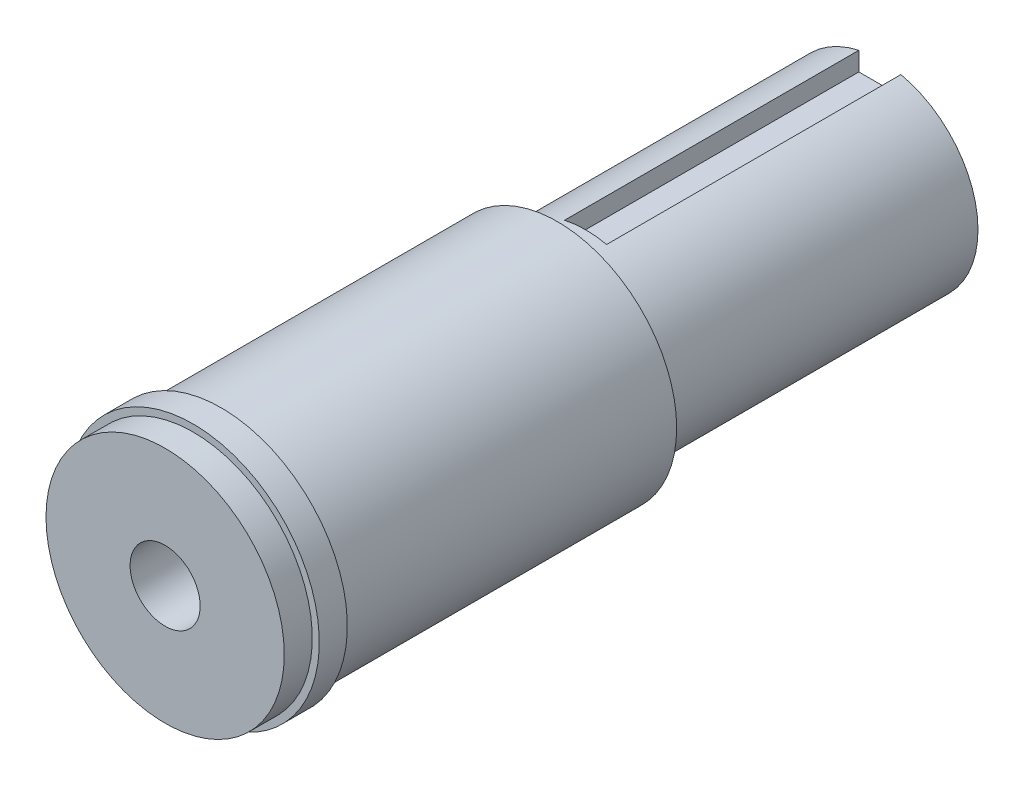
ISO-10303-21;
HEADER;
FILE_DESCRIPTION(('STEP AP214'),'2;1');
FILE_NAME('part.step','',(''),(''),'','','');
FILE_SCHEMA(('AUTOMOTIVE_DESIGN { 1 0 10303 214 1 1 1 1 }'));
ENDSEC;
DATA;
#1=APPLICATION_CONTEXT('core data for automotive mechanical design processes');
#2=APPLICATION_PROTOCOL_DEFINITION('international standard','automotive_design',2000,#1);
#3=PRODUCT_CONTEXT('',#1,'mechanical');
#4=PRODUCT('Part','Part','',(#3));
#5=PRODUCT_RELATED_PRODUCT_CATEGORY('part','',(#4));
#6=PRODUCT_DEFINITION_FORMATION('','',#4);
#7=PRODUCT_DEFINITION_CONTEXT('part definition',#1,'design');
#8=PRODUCT_DEFINITION('design','',#6,#7);
#9=PRODUCT_DEFINITION_SHAPE('','',#8);
#10=(LENGTH_UNIT() NAMED_UNIT(*) SI_UNIT(.MILLI.,.METRE.));
#11=(NAMED_UNIT(*) PLANE_ANGLE_UNIT() SI_UNIT($,.RADIAN.));
#12=(NAMED_UNIT(*) SI_UNIT($,.STERADIAN.) SOLID_ANGLE_UNIT());
#13=UNCERTAINTY_MEASURE_WITH_UNIT(LENGTH_MEASURE(1.E-05),#10,'distance_accuracy_value','');
#14=(GEOMETRIC_REPRESENTATION_CONTEXT(3) GLOBAL_UNCERTAINTY_ASSIGNED_CONTEXT((#13)) GLOBAL_UNIT_ASSIGNED_CONTEXT((#10,
#11,#12)) REPRESENTATION_CONTEXT('',''));
#15=CARTESIAN_POINT('',(0.,0.,0.));
#16=DIRECTION('',(0.,0.,1.));
#17=DIRECTION('',(1.,0.,0.));
#18=AXIS2_PLACEMENT_3D('',#15,#16,#17);
#19=CARTESIAN_POINT('',(0.,0.,23.));
#20=DIRECTION('',(0.,0.,-1.));
#21=DIRECTION('',(-1.,0.,0.));
#22=AXIS2_PLACEMENT_3D('',#19,#20,#21);
#23=CYLINDRICAL_SURFACE('',#22,7.);
#24=CARTESIAN_POINT('',(0.,0.,23.));
#25=DIRECTION('',(0.,0.,1.));
#26=DIRECTION('',(1.,0.,0.));
#27=AXIS2_PLACEMENT_3D('',#24,#25,#26);
#28=CIRCLE('',#27,7.);
#29=CARTESIAN_POINT('',(7.,0.,23.));
#30=VERTEX_POINT('',#29);
#31=EDGE_CURVE('E127',#30,#30,#28,.T.);
#32=ORIENTED_EDGE('',*,*,#31,.F.);
#33=EDGE_LOOP('',(#32));
#34=FACE_BOUND('',#33,.T.);
#35=CARTESIAN_POINT('',(0.,0.,21.));
#36=DIRECTION('',(0.,0.,1.));
#37=DIRECTION('',(1.,0.,0.));
#38=AXIS2_PLACEMENT_3D('',#35,#36,#37);
#39=CIRCLE('',#38,7.);
#40=CARTESIAN_POINT('',(1.5,6.83739716558867,21.));
#41=VERTEX_POINT('',#40);
#42=CARTESIAN_POINT('',(-1.5,6.83739716558867,21.));
#43=VERTEX_POINT('',#42);
#44=EDGE_CURVE('E43',#41,#43,#39,.T.);
#45=ORIENTED_EDGE('',*,*,#44,.T.);
#46=DIRECTION('',(0.,0.,-1.));
#47=VECTOR('',#46,1.);
#48=CARTESIAN_POINT('',(-1.5,6.83739716558867,23.));
#49=LINE('',#48,#47);
#50=CARTESIAN_POINT('',(-1.5,6.83739716558867,0.));
#51=VERTEX_POINT('',#50);
#52=EDGE_CURVE('E58',#43,#51,#49,.T.);
#53=ORIENTED_EDGE('',*,*,#52,.T.);
#54=CARTESIAN_POINT('',(0.,0.,0.));
#55=DIRECTION('',(0.,0.,1.));
#56=DIRECTION('',(1.,0.,0.));
#57=AXIS2_PLACEMENT_3D('',#54,#55,#56);
#58=CIRCLE('',#57,7.);
#59=CARTESIAN_POINT('',(1.5,6.83739716558867,0.));
#60=VERTEX_POINT('',#59);
#61=EDGE_CURVE('E126',#51,#60,#58,.T.);
#62=ORIENTED_EDGE('',*,*,#61,.T.);
#63=DIRECTION('',(0.,0.,-1.));
#64=VECTOR('',#63,1.);
#65=CARTESIAN_POINT('',(1.5,6.83739716558867,23.));
#66=LINE('',#65,#64);
#67=EDGE_CURVE('E50',#60,#41,#66,.F.);
#68=ORIENTED_EDGE('',*,*,#67,.T.);
#69=EDGE_LOOP('',(#45,#53,#62,#68));
#70=FACE_BOUND('',#69,.T.);
#71=ADVANCED_FACE('F36',(#34,#70),#23,.T.);
#72=CARTESIAN_POINT('',(0.,0.,0.));
#73=DIRECTION('',(0.,0.,1.));
#74=DIRECTION('',(1.,0.,0.));
#75=AXIS2_PLACEMENT_3D('',#72,#73,#74);
#76=PLANE('',#75);
#77=ORIENTED_EDGE('',*,*,#61,.F.);
#78=DIRECTION('',(0.,1.,0.));
#79=VECTOR('',#78,1.);
#80=CARTESIAN_POINT('',(-1.5,5.5,0.));
#81=LINE('',#80,#79);
#82=CARTESIAN_POINT('',(-1.5,5.5,0.));
#83=VERTEX_POINT('',#82);
#84=EDGE_CURVE('E104',#83,#51,#81,.T.);
#85=ORIENTED_EDGE('',*,*,#84,.F.);
#86=DIRECTION('',(-1.,0.,0.));
#87=VECTOR('',#86,1.);
#88=CARTESIAN_POINT('',(1.5,5.5,0.));
#89=LINE('',#88,#87);
#90=CARTESIAN_POINT('',(1.5,5.5,0.));
#91=VERTEX_POINT('',#90);
#92=EDGE_CURVE('E111',#91,#83,#89,.T.);
#93=ORIENTED_EDGE('',*,*,#92,.F.);
#94=DIRECTION('',(0.,1.,0.));
#95=VECTOR('',#94,1.);
#96=CARTESIAN_POINT('',(1.5,0.,0.));
#97=LINE('',#96,#95);
#98=EDGE_CURVE('E130',#91,#60,#97,.T.);
#99=ORIENTED_EDGE('',*,*,#98,.T.);
#100=EDGE_LOOP('',(#77,#85,#93,#99));
#101=FACE_BOUND('',#100,.T.);
#102=ADVANCED_FACE('F164',(#101),#76,.F.);
#103=CARTESIAN_POINT('',(0.,0.,21.));
#104=DIRECTION('',(0.,0.,1.));
#105=DIRECTION('',(1.,0.,0.));
#106=AXIS2_PLACEMENT_3D('',#103,#104,#105);
#107=PLANE('',#106);
#108=DIRECTION('',(0.,-1.,0.));
#109=VECTOR('',#108,1.);
#110=CARTESIAN_POINT('',(1.5,5.5,21.));
#111=LINE('',#110,#109);
#112=CARTESIAN_POINT('',(1.5,5.5,21.));
#113=VERTEX_POINT('',#112);
#114=EDGE_CURVE('E110',#41,#113,#111,.T.);
#115=ORIENTED_EDGE('',*,*,#114,.T.);
#116=DIRECTION('',(-1.,0.,0.));
#117=VECTOR('',#116,1.);
#118=CARTESIAN_POINT('',(1.5,5.5,21.));
#119=LINE('',#118,#117);
#120=CARTESIAN_POINT('',(-1.5,5.5,21.));
#121=VERTEX_POINT('',#120);
#122=EDGE_CURVE('E113',#113,#121,#119,.T.);
#123=ORIENTED_EDGE('',*,*,#122,.T.);
#124=DIRECTION('',(0.,1.,0.));
#125=VECTOR('',#124,1.);
#126=CARTESIAN_POINT('',(-1.5,5.5,21.));
#127=LINE('',#126,#125);
#128=EDGE_CURVE('E108',#121,#43,#127,.T.);
#129=ORIENTED_EDGE('',*,*,#128,.T.);
#130=ORIENTED_EDGE('',*,*,#44,.F.);
#131=EDGE_LOOP('',(#115,#123,#129,#130));
#132=FACE_BOUND('',#131,.T.);
#133=ADVANCED_FACE('F169',(#132),#107,.F.);
#134=CARTESIAN_POINT('',(-1.5,5.5,21.));
#135=DIRECTION('',(-1.,0.,0.));
#136=DIRECTION('',(0.,0.,1.));
#137=AXIS2_PLACEMENT_3D('',#134,#135,#136);
#138=PLANE('',#137);
#139=ORIENTED_EDGE('',*,*,#128,.F.);
#140=DIRECTION('',(0.,0.,-1.));
#141=VECTOR('',#140,1.);
#142=CARTESIAN_POINT('',(-1.5,5.5,21.));
#143=LINE('',#142,#141);
#144=EDGE_CURVE('E120',#121,#83,#143,.T.);
#145=ORIENTED_EDGE('',*,*,#144,.T.);
#146=ORIENTED_EDGE('',*,*,#84,.T.);
#147=ORIENTED_EDGE('',*,*,#52,.F.);
#148=EDGE_LOOP('',(#139,#145,#146,#147));
#149=FACE_BOUND('',#148,.T.);
#150=ADVANCED_FACE('F182',(#149),#138,.F.);
#151=CARTESIAN_POINT('',(1.5,5.5,21.));
#152=DIRECTION('',(1.,0.,0.));
#153=DIRECTION('',(0.,0.,-1.));
#154=AXIS2_PLACEMENT_3D('',#151,#152,#153);
#155=PLANE('',#154);
#156=ORIENTED_EDGE('',*,*,#98,.F.);
#157=DIRECTION('',(0.,0.,-1.));
#158=VECTOR('',#157,1.);
#159=CARTESIAN_POINT('',(1.5,5.5,21.));
#160=LINE('',#159,#158);
#161=EDGE_CURVE('E116',#113,#91,#160,.T.);
#162=ORIENTED_EDGE('',*,*,#161,.F.);
#163=ORIENTED_EDGE('',*,*,#114,.F.);
#164=ORIENTED_EDGE('',*,*,#67,.F.);
#165=EDGE_LOOP('',(#156,#162,#163,#164));
#166=FACE_BOUND('',#165,.T.);
#167=ADVANCED_FACE('F176',(#166),#155,.F.);
#168=CARTESIAN_POINT('',(1.5,5.5,21.));
#169=DIRECTION('',(0.,-1.,0.));
#170=DIRECTION('',(0.,0.,-1.));
#171=AXIS2_PLACEMENT_3D('',#168,#169,#170);
#172=PLANE('',#171);
#173=ORIENTED_EDGE('',*,*,#92,.T.);
#174=ORIENTED_EDGE('',*,*,#144,.F.);
#175=ORIENTED_EDGE('',*,*,#122,.F.);
#176=ORIENTED_EDGE('',*,*,#161,.T.);
#177=EDGE_LOOP('',(#173,#174,#175,#176));
#178=FACE_BOUND('',#177,.T.);
#179=ADVANCED_FACE('F180',(#178),#172,.F.);
#180=CARTESIAN_POINT('',(0.,0.,51.));
#181=DIRECTION('',(0.,0.,-1.));
#182=DIRECTION('',(-1.,0.,0.));
#183=AXIS2_PLACEMENT_3D('',#180,#181,#182);
#184=CYLINDRICAL_SURFACE('',#183,8.5);
#185=CARTESIAN_POINT('',(0.,0.,47.));
#186=DIRECTION('',(0.,0.,-1.));
#187=DIRECTION('',(-1.,0.,0.));
#188=AXIS2_PLACEMENT_3D('',#185,#186,#187);
#189=CIRCLE('',#188,8.5);
#190=CARTESIAN_POINT('',(-8.5,0.,47.));
#191=VERTEX_POINT('',#190);
#192=EDGE_CURVE('E99',#191,#191,#189,.T.);
#193=ORIENTED_EDGE('',*,*,#192,.T.);
#194=EDGE_LOOP('',(#193));
#195=FACE_BOUND('',#194,.T.);
#196=CARTESIAN_POINT('',(0.,0.,23.));
#197=DIRECTION('',(0.,0.,1.));
#198=DIRECTION('',(1.,0.,0.));
#199=AXIS2_PLACEMENT_3D('',#196,#197,#198);
#200=CIRCLE('',#199,8.5);
#201=CARTESIAN_POINT('',(8.5,0.,23.));
#202=VERTEX_POINT('',#201);
#203=EDGE_CURVE('E105',#202,#202,#200,.T.);
#204=ORIENTED_EDGE('',*,*,#203,.T.);
#205=EDGE_LOOP('',(#204));
#206=FACE_BOUND('',#205,.T.);
#207=ADVANCED_FACE('F138',(#195,#206),#184,.T.);
#208=CARTESIAN_POINT('',(0.,0.,23.));
#209=DIRECTION('',(0.,0.,1.));
#210=DIRECTION('',(1.,0.,0.));
#211=AXIS2_PLACEMENT_3D('',#208,#209,#210);
#212=PLANE('',#211);
#213=ORIENTED_EDGE('',*,*,#31,.T.);
#214=EDGE_LOOP('',(#213));
#215=FACE_BOUND('',#214,.T.);
#216=ORIENTED_EDGE('',*,*,#203,.F.);
#217=EDGE_LOOP('',(#216));
#218=FACE_BOUND('',#217,.T.);
#219=ADVANCED_FACE('F151',(#215,#218),#212,.F.);
#220=CARTESIAN_POINT('',(0.,0.,49.));
#221=DIRECTION('',(0.,0.,-1.));
#222=DIRECTION('',(-1.,0.,0.));
#223=AXIS2_PLACEMENT_3D('',#220,#221,#222);
#224=CYLINDRICAL_SURFACE('',#223,9.);
#225=CARTESIAN_POINT('',(0.,0.,49.));
#226=DIRECTION('',(0.,0.,-1.));
#227=DIRECTION('',(-1.,0.,0.));
#228=AXIS2_PLACEMENT_3D('',#225,#226,#227);
#229=CIRCLE('',#228,9.);
#230=CARTESIAN_POINT('',(-9.,0.,49.));
#231=VERTEX_POINT('',#230);
#232=EDGE_CURVE('E93',#231,#231,#229,.T.);
#233=ORIENTED_EDGE('',*,*,#232,.T.);
#234=EDGE_LOOP('',(#233));
#235=FACE_BOUND('',#234,.T.);
#236=CARTESIAN_POINT('',(0.,0.,47.));
#237=DIRECTION('',(0.,0.,-1.));
#238=DIRECTION('',(-1.,0.,0.));
#239=AXIS2_PLACEMENT_3D('',#236,#237,#238);
#240=CIRCLE('',#239,9.);
#241=CARTESIAN_POINT('',(-9.,0.,47.));
#242=VERTEX_POINT('',#241);
#243=EDGE_CURVE('E89',#242,#242,#240,.T.);
#244=ORIENTED_EDGE('',*,*,#243,.F.);
#245=EDGE_LOOP('',(#244));
#246=FACE_BOUND('',#245,.T.);
#247=ADVANCED_FACE('F149',(#235,#246),#224,.T.);
#248=CARTESIAN_POINT('',(0.,0.,49.));
#249=DIRECTION('',(0.,0.,-1.));
#250=DIRECTION('',(-1.,0.,0.));
#251=AXIS2_PLACEMENT_3D('',#248,#249,#250);
#252=PLANE('',#251);
#253=CARTESIAN_POINT('',(0.,0.,49.));
#254=DIRECTION('',(0.,0.,-1.));
#255=DIRECTION('',(-1.,0.,0.));
#256=AXIS2_PLACEMENT_3D('',#253,#254,#255);
#257=CIRCLE('',#256,8.5);
#258=CARTESIAN_POINT('',(-8.5,0.,49.));
#259=VERTEX_POINT('',#258);
#260=EDGE_CURVE('E11',#259,#259,#257,.T.);
#261=ORIENTED_EDGE('',*,*,#260,.T.);
#262=EDGE_LOOP('',(#261));
#263=FACE_BOUND('',#262,.T.);
#264=ORIENTED_EDGE('',*,*,#232,.F.);
#265=EDGE_LOOP('',(#264));
#266=FACE_BOUND('',#265,.T.);
#267=ADVANCED_FACE('F145',(#263,#266),#252,.F.);
#268=CARTESIAN_POINT('',(0.,0.,47.));
#269=DIRECTION('',(0.,0.,-1.));
#270=DIRECTION('',(-1.,0.,0.));
#271=AXIS2_PLACEMENT_3D('',#268,#269,#270);
#272=PLANE('',#271);
#273=ORIENTED_EDGE('',*,*,#192,.F.);
#274=EDGE_LOOP('',(#273));
#275=FACE_BOUND('',#274,.T.);
#276=ORIENTED_EDGE('',*,*,#243,.T.);
#277=EDGE_LOOP('',(#276));
#278=FACE_BOUND('',#277,.T.);
#279=ADVANCED_FACE('F141',(#275,#278),#272,.T.);
#280=CARTESIAN_POINT('',(0.,0.,51.));
#281=DIRECTION('',(0.,0.,1.));
#282=DIRECTION('',(1.,0.,0.));
#283=AXIS2_PLACEMENT_3D('',#280,#281,#282);
#284=PLANE('',#283);
#285=CARTESIAN_POINT('',(0.,0.,51.));
#286=DIRECTION('',(0.,0.,1.));
#287=DIRECTION('',(1.,0.,0.));
#288=AXIS2_PLACEMENT_3D('',#285,#286,#287);
#289=CIRCLE('',#288,2.49999999999999);
#290=CARTESIAN_POINT('',(2.49999999999999,0.,51.));
#291=VERTEX_POINT('',#290);
#292=EDGE_CURVE('E90',#291,#291,#289,.T.);
#293=ORIENTED_EDGE('',*,*,#292,.F.);
#294=EDGE_LOOP('',(#293));
#295=FACE_BOUND('',#294,.T.);
#296=CARTESIAN_POINT('',(0.,0.,51.));
#297=DIRECTION('',(0.,0.,1.));
#298=DIRECTION('',(1.,0.,0.));
#299=AXIS2_PLACEMENT_3D('',#296,#297,#298);
#300=CIRCLE('',#299,8.5);
#301=CARTESIAN_POINT('',(8.5,0.,51.));
#302=VERTEX_POINT('',#301);
#303=EDGE_CURVE('E101',#302,#302,#300,.T.);
#304=ORIENTED_EDGE('',*,*,#303,.T.);
#305=EDGE_LOOP('',(#304));
#306=FACE_BOUND('',#305,.T.);
#307=ADVANCED_FACE('F144',(#295,#306),#284,.T.);
#308=ORIENTED_EDGE('',*,*,#303,.F.);
#309=EDGE_LOOP('',(#308));
#310=FACE_BOUND('',#309,.T.);
#311=ORIENTED_EDGE('',*,*,#260,.F.);
#312=EDGE_LOOP('',(#311));
#313=FACE_BOUND('',#312,.T.);
#314=ADVANCED_FACE('F83',(#310,#313),#184,.T.);
#315=CARTESIAN_POINT('',(0.,0.,31.));
#316=DIRECTION('',(0.,0.,1.));
#317=DIRECTION('',(1.,0.,0.));
#318=AXIS2_PLACEMENT_3D('',#315,#316,#317);
#319=CONICAL_SURFACE('',#318,2.5,1.02974425867665);
#320=CARTESIAN_POINT('',(0.,0.,29.4978484524311));
#321=VERTEX_POINT('',#320);
#322=VERTEX_LOOP('',#321);
#323=FACE_BOUND('',#322,.T.);
#324=CARTESIAN_POINT('',(0.,0.,31.));
#325=DIRECTION('',(0.,0.,1.));
#326=DIRECTION('',(1.,0.,0.));
#327=AXIS2_PLACEMENT_3D('',#324,#325,#326);
#328=CIRCLE('',#327,2.5);
#329=CARTESIAN_POINT('',(2.5,0.,31.));
#330=VERTEX_POINT('',#329);
#331=EDGE_CURVE('E87',#330,#330,#328,.T.);
#332=ORIENTED_EDGE('',*,*,#331,.T.);
#333=EDGE_LOOP('',(#332));
#334=FACE_BOUND('',#333,.T.);
#335=ADVANCED_FACE('F79',(#323,#334),#319,.F.);
#336=CARTESIAN_POINT('',(0.,0.,51.));
#337=DIRECTION('',(0.,0.,1.));
#338=DIRECTION('',(1.,0.,0.));
#339=AXIS2_PLACEMENT_3D('',#336,#337,#338);
#340=CYLINDRICAL_SURFACE('',#339,2.49999999999999);
#341=ORIENTED_EDGE('',*,*,#331,.F.);
#342=EDGE_LOOP('',(#341));
#343=FACE_BOUND('',#342,.T.);
#344=ORIENTED_EDGE('',*,*,#292,.T.);
#345=EDGE_LOOP('',(#344));
#346=FACE_BOUND('',#345,.T.);
#347=ADVANCED_FACE('F82',(#343,#346),#340,.F.);
#348=CLOSED_SHELL('',(#71,#102,#133,#150,#167,#179,#207,#219,#247,#267,#279,#307,#314,#335,#347));
#349=MANIFOLD_SOLID_BREP('B2',#348);
#350=ADVANCED_BREP_SHAPE_REPRESENTATION('',(#18,#349),#14);
#351=SHAPE_DEFINITION_REPRESENTATION(#9,#350);
ENDSEC;
END-ISO-10303-21;
